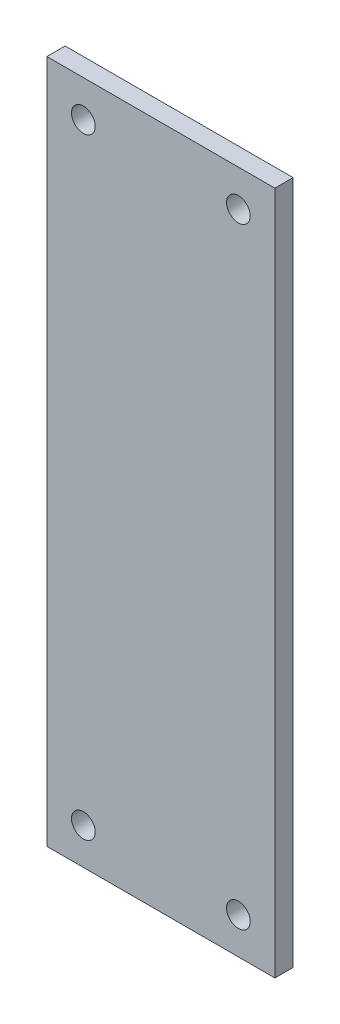
ISO-10303-21;
HEADER;
FILE_DESCRIPTION(('STEP AP214'),'2;1');
FILE_NAME('part.step','',(''),(''),'','','');
FILE_SCHEMA(('AUTOMOTIVE_DESIGN { 1 0 10303 214 1 1 1 1 }'));
ENDSEC;
DATA;
#1=APPLICATION_CONTEXT('core data for automotive mechanical design processes');
#2=APPLICATION_PROTOCOL_DEFINITION('international standard','automotive_design',2000,#1);
#3=PRODUCT_CONTEXT('',#1,'mechanical');
#4=PRODUCT('Part','Part','',(#3));
#5=PRODUCT_RELATED_PRODUCT_CATEGORY('part','',(#4));
#6=PRODUCT_DEFINITION_FORMATION('','',#4);
#7=PRODUCT_DEFINITION_CONTEXT('part definition',#1,'design');
#8=PRODUCT_DEFINITION('design','',#6,#7);
#9=PRODUCT_DEFINITION_SHAPE('','',#8);
#10=(LENGTH_UNIT() NAMED_UNIT(*) SI_UNIT(.MILLI.,.METRE.));
#11=(NAMED_UNIT(*) PLANE_ANGLE_UNIT() SI_UNIT($,.RADIAN.));
#12=(NAMED_UNIT(*) SI_UNIT($,.STERADIAN.) SOLID_ANGLE_UNIT());
#13=UNCERTAINTY_MEASURE_WITH_UNIT(LENGTH_MEASURE(1.E-05),#10,'distance_accuracy_value','');
#14=(GEOMETRIC_REPRESENTATION_CONTEXT(3) GLOBAL_UNCERTAINTY_ASSIGNED_CONTEXT((#13)) GLOBAL_UNIT_ASSIGNED_CONTEXT((#10,
#11,#12)) REPRESENTATION_CONTEXT('',''));
#15=CARTESIAN_POINT('',(0.,0.,0.));
#16=DIRECTION('',(0.,0.,1.));
#17=DIRECTION('',(1.,0.,0.));
#18=AXIS2_PLACEMENT_3D('',#15,#16,#17);
#19=CARTESIAN_POINT('',(0.,0.,20.));
#20=DIRECTION('',(0.,0.,1.));
#21=DIRECTION('',(1.,0.,0.));
#22=AXIS2_PLACEMENT_3D('',#19,#20,#21);
#23=PLANE('',#22);
#24=CARTESIAN_POINT('',(-85.,335.,20.));
#25=DIRECTION('',(0.,0.,1.));
#26=DIRECTION('',(1.,0.,0.));
#27=AXIS2_PLACEMENT_3D('',#24,#25,#26);
#28=CIRCLE('',#27,13.);
#29=CARTESIAN_POINT('',(-72.,335.,20.));
#30=VERTEX_POINT('',#29);
#31=EDGE_CURVE('E122',#30,#30,#28,.T.);
#32=ORIENTED_EDGE('',*,*,#31,.F.);
#33=EDGE_LOOP('',(#32));
#34=FACE_BOUND('',#33,.T.);
#35=CARTESIAN_POINT('',(-85.,-335.,20.));
#36=DIRECTION('',(0.,0.,1.));
#37=DIRECTION('',(1.,0.,0.));
#38=AXIS2_PLACEMENT_3D('',#35,#36,#37);
#39=CIRCLE('',#38,13.);
#40=CARTESIAN_POINT('',(-72.,-335.,20.));
#41=VERTEX_POINT('',#40);
#42=EDGE_CURVE('E101',#41,#41,#39,.T.);
#43=ORIENTED_EDGE('',*,*,#42,.F.);
#44=EDGE_LOOP('',(#43));
#45=FACE_BOUND('',#44,.T.);
#46=DIRECTION('',(1.,0.,0.));
#47=VECTOR('',#46,1.);
#48=CARTESIAN_POINT('',(-125.,-375.,20.));
#49=LINE('',#48,#47);
#50=CARTESIAN_POINT('',(-125.,-375.,20.));
#51=VERTEX_POINT('',#50);
#52=CARTESIAN_POINT('',(125.,-375.,20.));
#53=VERTEX_POINT('',#52);
#54=EDGE_CURVE('E86',#51,#53,#49,.T.);
#55=ORIENTED_EDGE('',*,*,#54,.T.);
#56=DIRECTION('',(0.,1.,0.));
#57=VECTOR('',#56,1.);
#58=CARTESIAN_POINT('',(125.,-375.,20.));
#59=LINE('',#58,#57);
#60=CARTESIAN_POINT('',(125.,375.,20.));
#61=VERTEX_POINT('',#60);
#62=EDGE_CURVE('E81',#53,#61,#59,.T.);
#63=ORIENTED_EDGE('',*,*,#62,.T.);
#64=DIRECTION('',(-1.,0.,0.));
#65=VECTOR('',#64,1.);
#66=CARTESIAN_POINT('',(125.,375.,20.));
#67=LINE('',#66,#65);
#68=CARTESIAN_POINT('',(-125.,375.,20.));
#69=VERTEX_POINT('',#68);
#70=EDGE_CURVE('E84',#61,#69,#67,.T.);
#71=ORIENTED_EDGE('',*,*,#70,.T.);
#72=DIRECTION('',(0.,-1.,0.));
#73=VECTOR('',#72,1.);
#74=CARTESIAN_POINT('',(-125.,375.,20.));
#75=LINE('',#74,#73);
#76=EDGE_CURVE('E51',#69,#51,#75,.T.);
#77=ORIENTED_EDGE('',*,*,#76,.T.);
#78=EDGE_LOOP('',(#55,#63,#71,#77));
#79=FACE_BOUND('',#78,.T.);
#80=CARTESIAN_POINT('',(85.,-335.,20.));
#81=DIRECTION('',(0.,0.,1.));
#82=DIRECTION('',(1.,0.,0.));
#83=AXIS2_PLACEMENT_3D('',#80,#81,#82);
#84=CIRCLE('',#83,13.);
#85=CARTESIAN_POINT('',(98.,-335.,20.));
#86=VERTEX_POINT('',#85);
#87=EDGE_CURVE('E116',#86,#86,#84,.T.);
#88=ORIENTED_EDGE('',*,*,#87,.F.);
#89=EDGE_LOOP('',(#88));
#90=FACE_BOUND('',#89,.T.);
#91=CARTESIAN_POINT('',(85.,335.,20.));
#92=DIRECTION('',(0.,0.,1.));
#93=DIRECTION('',(1.,0.,0.));
#94=AXIS2_PLACEMENT_3D('',#91,#92,#93);
#95=CIRCLE('',#94,13.);
#96=CARTESIAN_POINT('',(98.,335.,20.));
#97=VERTEX_POINT('',#96);
#98=EDGE_CURVE('E128',#97,#97,#95,.T.);
#99=ORIENTED_EDGE('',*,*,#98,.F.);
#100=EDGE_LOOP('',(#99));
#101=FACE_BOUND('',#100,.T.);
#102=ADVANCED_FACE('F34',(#34,#45,#79,#90,#101),#23,.T.);
#103=CARTESIAN_POINT('',(0.,0.,0.));
#104=DIRECTION('',(0.,0.,1.));
#105=DIRECTION('',(1.,0.,0.));
#106=AXIS2_PLACEMENT_3D('',#103,#104,#105);
#107=PLANE('',#106);
#108=DIRECTION('',(1.,0.,0.));
#109=VECTOR('',#108,1.);
#110=CARTESIAN_POINT('',(-125.,-375.,0.));
#111=LINE('',#110,#109);
#112=CARTESIAN_POINT('',(-125.,-375.,0.));
#113=VERTEX_POINT('',#112);
#114=CARTESIAN_POINT('',(125.,-375.,0.));
#115=VERTEX_POINT('',#114);
#116=EDGE_CURVE('E98',#113,#115,#111,.T.);
#117=ORIENTED_EDGE('',*,*,#116,.F.);
#118=DIRECTION('',(0.,-1.,0.));
#119=VECTOR('',#118,1.);
#120=CARTESIAN_POINT('',(-125.,375.,0.));
#121=LINE('',#120,#119);
#122=CARTESIAN_POINT('',(-125.,375.,0.));
#123=VERTEX_POINT('',#122);
#124=EDGE_CURVE('E74',#123,#113,#121,.T.);
#125=ORIENTED_EDGE('',*,*,#124,.F.);
#126=DIRECTION('',(-1.,0.,0.));
#127=VECTOR('',#126,1.);
#128=CARTESIAN_POINT('',(125.,375.,0.));
#129=LINE('',#128,#127);
#130=CARTESIAN_POINT('',(125.,375.,0.));
#131=VERTEX_POINT('',#130);
#132=EDGE_CURVE('E68',#131,#123,#129,.T.);
#133=ORIENTED_EDGE('',*,*,#132,.F.);
#134=DIRECTION('',(0.,1.,0.));
#135=VECTOR('',#134,1.);
#136=CARTESIAN_POINT('',(125.,-375.,0.));
#137=LINE('',#136,#135);
#138=EDGE_CURVE('E90',#115,#131,#137,.T.);
#139=ORIENTED_EDGE('',*,*,#138,.F.);
#140=EDGE_LOOP('',(#117,#125,#133,#139));
#141=FACE_BOUND('',#140,.T.);
#142=CARTESIAN_POINT('',(-85.,-335.,0.));
#143=DIRECTION('',(0.,0.,1.));
#144=DIRECTION('',(1.,0.,0.));
#145=AXIS2_PLACEMENT_3D('',#142,#143,#144);
#146=CIRCLE('',#145,13.);
#147=CARTESIAN_POINT('',(-72.,-335.,0.));
#148=VERTEX_POINT('',#147);
#149=EDGE_CURVE('E113',#148,#148,#146,.T.);
#150=ORIENTED_EDGE('',*,*,#149,.T.);
#151=EDGE_LOOP('',(#150));
#152=FACE_BOUND('',#151,.T.);
#153=CARTESIAN_POINT('',(85.,-335.,0.));
#154=DIRECTION('',(0.,0.,1.));
#155=DIRECTION('',(1.,0.,0.));
#156=AXIS2_PLACEMENT_3D('',#153,#154,#155);
#157=CIRCLE('',#156,13.);
#158=CARTESIAN_POINT('',(98.,-335.,0.));
#159=VERTEX_POINT('',#158);
#160=EDGE_CURVE('E119',#159,#159,#157,.T.);
#161=ORIENTED_EDGE('',*,*,#160,.T.);
#162=EDGE_LOOP('',(#161));
#163=FACE_BOUND('',#162,.T.);
#164=CARTESIAN_POINT('',(-85.,335.,0.));
#165=DIRECTION('',(0.,0.,1.));
#166=DIRECTION('',(1.,0.,0.));
#167=AXIS2_PLACEMENT_3D('',#164,#165,#166);
#168=CIRCLE('',#167,13.);
#169=CARTESIAN_POINT('',(-72.,335.,0.));
#170=VERTEX_POINT('',#169);
#171=EDGE_CURVE('E125',#170,#170,#168,.T.);
#172=ORIENTED_EDGE('',*,*,#171,.T.);
#173=EDGE_LOOP('',(#172));
#174=FACE_BOUND('',#173,.T.);
#175=CARTESIAN_POINT('',(85.,335.,0.));
#176=DIRECTION('',(0.,0.,1.));
#177=DIRECTION('',(1.,0.,0.));
#178=AXIS2_PLACEMENT_3D('',#175,#176,#177);
#179=CIRCLE('',#178,13.);
#180=CARTESIAN_POINT('',(98.,335.,0.));
#181=VERTEX_POINT('',#180);
#182=EDGE_CURVE('E131',#181,#181,#179,.T.);
#183=ORIENTED_EDGE('',*,*,#182,.T.);
#184=EDGE_LOOP('',(#183));
#185=FACE_BOUND('',#184,.T.);
#186=ADVANCED_FACE('F109',(#141,#152,#163,#174,#185),#107,.F.);
#187=CARTESIAN_POINT('',(-125.,-375.,20.));
#188=DIRECTION('',(0.,1.,0.));
#189=DIRECTION('',(0.,0.,1.));
#190=AXIS2_PLACEMENT_3D('',#187,#188,#189);
#191=PLANE('',#190);
#192=ORIENTED_EDGE('',*,*,#116,.T.);
#193=DIRECTION('',(0.,0.,-1.));
#194=VECTOR('',#193,1.);
#195=CARTESIAN_POINT('',(125.,-375.,20.));
#196=LINE('',#195,#194);
#197=EDGE_CURVE('E11',#53,#115,#196,.T.);
#198=ORIENTED_EDGE('',*,*,#197,.F.);
#199=ORIENTED_EDGE('',*,*,#54,.F.);
#200=DIRECTION('',(0.,0.,-1.));
#201=VECTOR('',#200,1.);
#202=CARTESIAN_POINT('',(-125.,-375.,20.));
#203=LINE('',#202,#201);
#204=EDGE_CURVE('E94',#51,#113,#203,.T.);
#205=ORIENTED_EDGE('',*,*,#204,.T.);
#206=EDGE_LOOP('',(#192,#198,#199,#205));
#207=FACE_BOUND('',#206,.T.);
#208=ADVANCED_FACE('F36',(#207),#191,.F.);
#209=CARTESIAN_POINT('',(125.,-375.,20.));
#210=DIRECTION('',(-1.,0.,0.));
#211=DIRECTION('',(0.,0.,1.));
#212=AXIS2_PLACEMENT_3D('',#209,#210,#211);
#213=PLANE('',#212);
#214=ORIENTED_EDGE('',*,*,#138,.T.);
#215=DIRECTION('',(0.,0.,-1.));
#216=VECTOR('',#215,1.);
#217=CARTESIAN_POINT('',(125.,375.,20.));
#218=LINE('',#217,#216);
#219=EDGE_CURVE('E43',#61,#131,#218,.T.);
#220=ORIENTED_EDGE('',*,*,#219,.F.);
#221=ORIENTED_EDGE('',*,*,#62,.F.);
#222=ORIENTED_EDGE('',*,*,#197,.T.);
#223=EDGE_LOOP('',(#214,#220,#221,#222));
#224=FACE_BOUND('',#223,.T.);
#225=ADVANCED_FACE('F89',(#224),#213,.F.);
#226=CARTESIAN_POINT('',(125.,375.,20.));
#227=DIRECTION('',(0.,-1.,0.));
#228=DIRECTION('',(0.,0.,-1.));
#229=AXIS2_PLACEMENT_3D('',#226,#227,#228);
#230=PLANE('',#229);
#231=ORIENTED_EDGE('',*,*,#132,.T.);
#232=DIRECTION('',(0.,0.,-1.));
#233=VECTOR('',#232,1.);
#234=CARTESIAN_POINT('',(-125.,375.,20.));
#235=LINE('',#234,#233);
#236=EDGE_CURVE('E91',#69,#123,#235,.T.);
#237=ORIENTED_EDGE('',*,*,#236,.F.);
#238=ORIENTED_EDGE('',*,*,#70,.F.);
#239=ORIENTED_EDGE('',*,*,#219,.T.);
#240=EDGE_LOOP('',(#231,#237,#238,#239));
#241=FACE_BOUND('',#240,.T.);
#242=ADVANCED_FACE('F92',(#241),#230,.F.);
#243=CARTESIAN_POINT('',(-125.,375.,20.));
#244=DIRECTION('',(1.,0.,0.));
#245=DIRECTION('',(0.,0.,-1.));
#246=AXIS2_PLACEMENT_3D('',#243,#244,#245);
#247=PLANE('',#246);
#248=ORIENTED_EDGE('',*,*,#124,.T.);
#249=ORIENTED_EDGE('',*,*,#204,.F.);
#250=ORIENTED_EDGE('',*,*,#76,.F.);
#251=ORIENTED_EDGE('',*,*,#236,.T.);
#252=EDGE_LOOP('',(#248,#249,#250,#251));
#253=FACE_BOUND('',#252,.T.);
#254=ADVANCED_FACE('F106',(#253),#247,.F.);
#255=CARTESIAN_POINT('',(-85.,-335.,20.));
#256=DIRECTION('',(0.,0.,-1.));
#257=DIRECTION('',(-1.,0.,0.));
#258=AXIS2_PLACEMENT_3D('',#255,#256,#257);
#259=CYLINDRICAL_SURFACE('',#258,13.);
#260=ORIENTED_EDGE('',*,*,#42,.T.);
#261=EDGE_LOOP('',(#260));
#262=FACE_BOUND('',#261,.T.);
#263=ORIENTED_EDGE('',*,*,#149,.F.);
#264=EDGE_LOOP('',(#263));
#265=FACE_BOUND('',#264,.T.);
#266=ADVANCED_FACE('F150',(#262,#265),#259,.F.);
#267=CARTESIAN_POINT('',(85.,-335.,20.));
#268=DIRECTION('',(0.,0.,-1.));
#269=DIRECTION('',(-1.,0.,0.));
#270=AXIS2_PLACEMENT_3D('',#267,#268,#269);
#271=CYLINDRICAL_SURFACE('',#270,13.);
#272=ORIENTED_EDGE('',*,*,#87,.T.);
#273=EDGE_LOOP('',(#272));
#274=FACE_BOUND('',#273,.T.);
#275=ORIENTED_EDGE('',*,*,#160,.F.);
#276=EDGE_LOOP('',(#275));
#277=FACE_BOUND('',#276,.T.);
#278=ADVANCED_FACE('F196',(#274,#277),#271,.F.);
#279=CARTESIAN_POINT('',(-85.,335.,20.));
#280=DIRECTION('',(0.,0.,-1.));
#281=DIRECTION('',(-1.,0.,0.));
#282=AXIS2_PLACEMENT_3D('',#279,#280,#281);
#283=CYLINDRICAL_SURFACE('',#282,13.);
#284=ORIENTED_EDGE('',*,*,#31,.T.);
#285=EDGE_LOOP('',(#284));
#286=FACE_BOUND('',#285,.T.);
#287=ORIENTED_EDGE('',*,*,#171,.F.);
#288=EDGE_LOOP('',(#287));
#289=FACE_BOUND('',#288,.T.);
#290=ADVANCED_FACE('F204',(#286,#289),#283,.F.);
#291=CARTESIAN_POINT('',(85.,335.,20.));
#292=DIRECTION('',(0.,0.,-1.));
#293=DIRECTION('',(-1.,0.,0.));
#294=AXIS2_PLACEMENT_3D('',#291,#292,#293);
#295=CYLINDRICAL_SURFACE('',#294,13.);
#296=ORIENTED_EDGE('',*,*,#98,.T.);
#297=EDGE_LOOP('',(#296));
#298=FACE_BOUND('',#297,.T.);
#299=ORIENTED_EDGE('',*,*,#182,.F.);
#300=EDGE_LOOP('',(#299));
#301=FACE_BOUND('',#300,.T.);
#302=ADVANCED_FACE('F137',(#298,#301),#295,.F.);
#303=CLOSED_SHELL('',(#102,#186,#208,#225,#242,#254,#266,#278,#290,#302));
#304=MANIFOLD_SOLID_BREP('B2',#303);
#305=ADVANCED_BREP_SHAPE_REPRESENTATION('',(#18,#304),#14);
#306=SHAPE_DEFINITION_REPRESENTATION(#9,#305);
ENDSEC;
END-ISO-10303-21;
